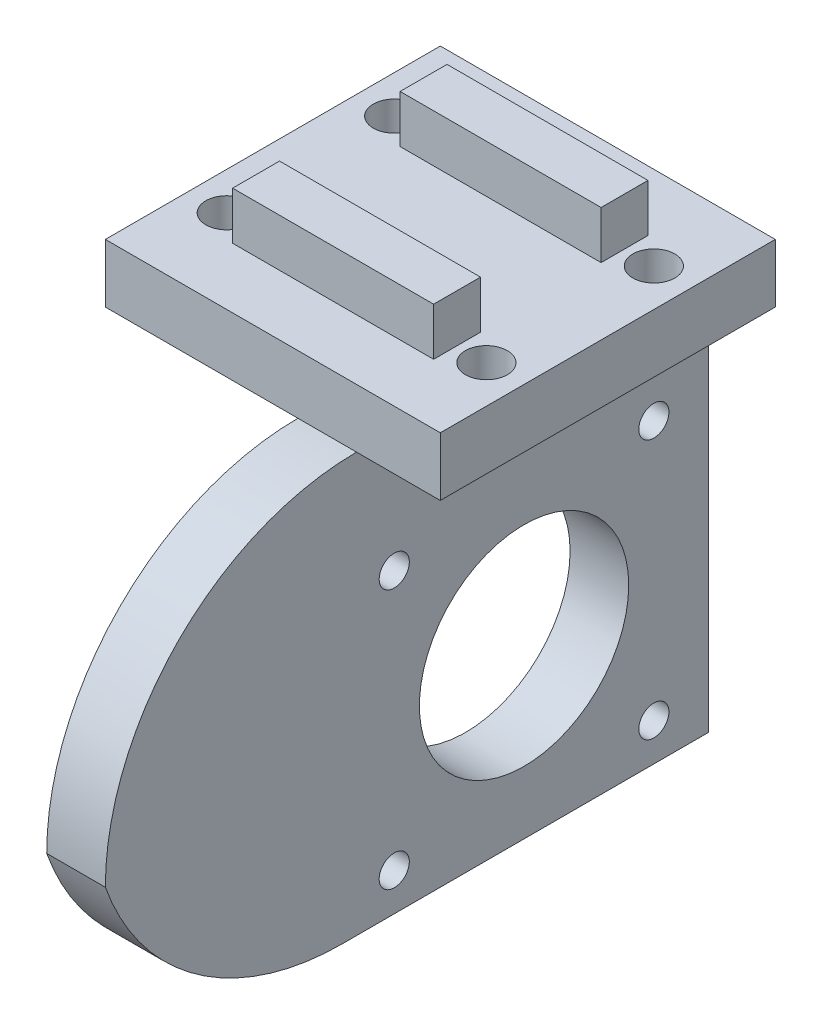
ISO-10303-21;
HEADER;
FILE_DESCRIPTION(('STEP AP214'),'2;1');
FILE_NAME('part.step','',(''),(''),'','','');
FILE_SCHEMA(('AUTOMOTIVE_DESIGN { 1 0 10303 214 1 1 1 1 }'));
ENDSEC;
DATA;
#1=APPLICATION_CONTEXT('core data for automotive mechanical design processes');
#2=APPLICATION_PROTOCOL_DEFINITION('international standard','automotive_design',2000,#1);
#3=PRODUCT_CONTEXT('',#1,'mechanical');
#4=PRODUCT('Part','Part','',(#3));
#5=PRODUCT_RELATED_PRODUCT_CATEGORY('part','',(#4));
#6=PRODUCT_DEFINITION_FORMATION('','',#4);
#7=PRODUCT_DEFINITION_CONTEXT('part definition',#1,'design');
#8=PRODUCT_DEFINITION('design','',#6,#7);
#9=PRODUCT_DEFINITION_SHAPE('','',#8);
#10=(LENGTH_UNIT() NAMED_UNIT(*) SI_UNIT(.MILLI.,.METRE.));
#11=(NAMED_UNIT(*) PLANE_ANGLE_UNIT() SI_UNIT($,.RADIAN.));
#12=(NAMED_UNIT(*) SI_UNIT($,.STERADIAN.) SOLID_ANGLE_UNIT());
#13=UNCERTAINTY_MEASURE_WITH_UNIT(LENGTH_MEASURE(1.E-05),#10,'distance_accuracy_value','');
#14=(GEOMETRIC_REPRESENTATION_CONTEXT(3) GLOBAL_UNCERTAINTY_ASSIGNED_CONTEXT((#13)) GLOBAL_UNIT_ASSIGNED_CONTEXT((#10,
#11,#12)) REPRESENTATION_CONTEXT('',''));
#15=CARTESIAN_POINT('',(0.,0.,0.));
#16=DIRECTION('',(0.,0.,1.));
#17=DIRECTION('',(1.,0.,0.));
#18=AXIS2_PLACEMENT_3D('',#15,#16,#17);
#19=CARTESIAN_POINT('',(0.,0.,0.));
#20=DIRECTION('',(0.,-1.,0.));
#21=DIRECTION('',(0.,0.,-1.));
#22=AXIS2_PLACEMENT_3D('',#19,#20,#21);
#23=PLANE('',#22);
#24=DIRECTION('',(0.,0.,-1.));
#25=VECTOR('',#24,1.);
#26=CARTESIAN_POINT('',(2.99999999999999,0.,50.));
#27=LINE('',#26,#25);
#28=CARTESIAN_POINT('',(3.,0.,20.));
#29=VERTEX_POINT('',#28);
#30=CARTESIAN_POINT('',(3.,0.,-20.));
#31=VERTEX_POINT('',#30);
#32=EDGE_CURVE('E303',#29,#31,#27,.T.);
#33=ORIENTED_EDGE('',*,*,#32,.F.);
#34=DIRECTION('',(1.,0.,0.));
#35=VECTOR('',#34,1.);
#36=CARTESIAN_POINT('',(20.,0.,20.));
#37=LINE('',#36,#35);
#38=CARTESIAN_POINT('',(-20.,0.,20.));
#39=VERTEX_POINT('',#38);
#40=EDGE_CURVE('E274',#39,#29,#37,.T.);
#41=ORIENTED_EDGE('',*,*,#40,.F.);
#42=DIRECTION('',(0.,0.,1.));
#43=VECTOR('',#42,1.);
#44=CARTESIAN_POINT('',(-20.,0.,-20.));
#45=LINE('',#44,#43);
#46=CARTESIAN_POINT('',(-20.,0.,-20.));
#47=VERTEX_POINT('',#46);
#48=EDGE_CURVE('E252',#47,#39,#45,.T.);
#49=ORIENTED_EDGE('',*,*,#48,.F.);
#50=DIRECTION('',(-1.,0.,0.));
#51=VECTOR('',#50,1.);
#52=CARTESIAN_POINT('',(20.,0.,-20.));
#53=LINE('',#52,#51);
#54=EDGE_CURVE('E280',#31,#47,#53,.T.);
#55=ORIENTED_EDGE('',*,*,#54,.F.);
#56=EDGE_LOOP('',(#33,#41,#49,#55));
#57=FACE_BOUND('',#56,.T.);
#58=CARTESIAN_POINT('',(-15.5,0.,-10.));
#59=DIRECTION('',(0.,-1.,0.));
#60=DIRECTION('',(0.,0.,-1.));
#61=AXIS2_PLACEMENT_3D('',#58,#59,#60);
#62=CIRCLE('',#61,2.5);
#63=CARTESIAN_POINT('',(-15.5,0.,-12.5));
#64=VERTEX_POINT('',#63);
#65=EDGE_CURVE('E207',#64,#64,#62,.F.);
#66=ORIENTED_EDGE('',*,*,#65,.T.);
#67=EDGE_LOOP('',(#66));
#68=FACE_BOUND('',#67,.T.);
#69=CARTESIAN_POINT('',(-15.5,0.,10.));
#70=DIRECTION('',(0.,-1.,0.));
#71=DIRECTION('',(0.,0.,-1.));
#72=AXIS2_PLACEMENT_3D('',#69,#70,#71);
#73=CIRCLE('',#72,2.5);
#74=CARTESIAN_POINT('',(-15.5,0.,7.50000000000001));
#75=VERTEX_POINT('',#74);
#76=EDGE_CURVE('E185',#75,#75,#73,.F.);
#77=ORIENTED_EDGE('',*,*,#76,.T.);
#78=EDGE_LOOP('',(#77));
#79=FACE_BOUND('',#78,.T.);
#80=ADVANCED_FACE('F34',(#57,#68,#79),#23,.T.);
#81=CARTESIAN_POINT('',(-20.,7.,-20.));
#82=DIRECTION('',(1.,0.,0.));
#83=DIRECTION('',(0.,0.,-1.));
#84=AXIS2_PLACEMENT_3D('',#81,#82,#83);
#85=PLANE('',#84);
#86=DIRECTION('',(0.,-1.,0.));
#87=VECTOR('',#86,1.);
#88=CARTESIAN_POINT('',(-20.,7.,20.));
#89=LINE('',#88,#87);
#90=CARTESIAN_POINT('',(-20.,7.,20.));
#91=VERTEX_POINT('',#90);
#92=EDGE_CURVE('E292',#91,#39,#89,.T.);
#93=ORIENTED_EDGE('',*,*,#92,.F.);
#94=DIRECTION('',(0.,0.,1.));
#95=VECTOR('',#94,1.);
#96=CARTESIAN_POINT('',(-20.,7.,-20.));
#97=LINE('',#96,#95);
#98=CARTESIAN_POINT('',(-20.,7.,-20.));
#99=VERTEX_POINT('',#98);
#100=EDGE_CURVE('E261',#99,#91,#97,.T.);
#101=ORIENTED_EDGE('',*,*,#100,.F.);
#102=DIRECTION('',(0.,-1.,0.));
#103=VECTOR('',#102,1.);
#104=CARTESIAN_POINT('',(-20.,7.,-20.));
#105=LINE('',#104,#103);
#106=EDGE_CURVE('E270',#99,#47,#105,.T.);
#107=ORIENTED_EDGE('',*,*,#106,.T.);
#108=ORIENTED_EDGE('',*,*,#48,.T.);
#109=EDGE_LOOP('',(#93,#101,#107,#108));
#110=FACE_BOUND('',#109,.T.);
#111=ADVANCED_FACE('F393',(#110),#85,.F.);
#112=CARTESIAN_POINT('',(20.,7.,20.));
#113=DIRECTION('',(0.,0.,-1.));
#114=DIRECTION('',(-1.,0.,0.));
#115=AXIS2_PLACEMENT_3D('',#112,#113,#114);
#116=PLANE('',#115);
#117=ORIENTED_EDGE('',*,*,#40,.T.);
#118=CARTESIAN_POINT('',(10.,0.,20.));
#119=VERTEX_POINT('',#118);
#120=EDGE_CURVE('E278',#29,#119,#37,.T.);
#121=ORIENTED_EDGE('',*,*,#120,.T.);
#122=CARTESIAN_POINT('',(20.,0.,20.));
#123=VERTEX_POINT('',#122);
#124=EDGE_CURVE('E273',#119,#123,#37,.T.);
#125=ORIENTED_EDGE('',*,*,#124,.T.);
#126=DIRECTION('',(0.,-1.,0.));
#127=VECTOR('',#126,1.);
#128=CARTESIAN_POINT('',(20.,7.,20.));
#129=LINE('',#128,#127);
#130=CARTESIAN_POINT('',(20.,7.,20.));
#131=VERTEX_POINT('',#130);
#132=EDGE_CURVE('E289',#131,#123,#129,.T.);
#133=ORIENTED_EDGE('',*,*,#132,.F.);
#134=DIRECTION('',(1.,0.,0.));
#135=VECTOR('',#134,1.);
#136=CARTESIAN_POINT('',(20.,7.,20.));
#137=LINE('',#136,#135);
#138=EDGE_CURVE('E263',#91,#131,#137,.T.);
#139=ORIENTED_EDGE('',*,*,#138,.F.);
#140=ORIENTED_EDGE('',*,*,#92,.T.);
#141=EDGE_LOOP('',(#117,#121,#125,#133,#139,#140));
#142=FACE_BOUND('',#141,.T.);
#143=ADVANCED_FACE('F367',(#142),#116,.F.);
#144=CARTESIAN_POINT('',(20.,7.,-20.));
#145=DIRECTION('',(-1.,0.,0.));
#146=DIRECTION('',(0.,0.,1.));
#147=AXIS2_PLACEMENT_3D('',#144,#145,#146);
#148=PLANE('',#147);
#149=DIRECTION('',(0.,-1.,0.));
#150=VECTOR('',#149,1.);
#151=CARTESIAN_POINT('',(20.,7.,-20.));
#152=LINE('',#151,#150);
#153=CARTESIAN_POINT('',(20.,7.,-20.));
#154=VERTEX_POINT('',#153);
#155=CARTESIAN_POINT('',(20.,0.,-20.));
#156=VERTEX_POINT('',#155);
#157=EDGE_CURVE('E286',#154,#156,#152,.T.);
#158=ORIENTED_EDGE('',*,*,#157,.F.);
#159=DIRECTION('',(0.,0.,-1.));
#160=VECTOR('',#159,1.);
#161=CARTESIAN_POINT('',(20.,7.,-20.));
#162=LINE('',#161,#160);
#163=EDGE_CURVE('E266',#131,#154,#162,.T.);
#164=ORIENTED_EDGE('',*,*,#163,.F.);
#165=ORIENTED_EDGE('',*,*,#132,.T.);
#166=DIRECTION('',(0.,0.,-1.));
#167=VECTOR('',#166,1.);
#168=CARTESIAN_POINT('',(20.,0.,-20.));
#169=LINE('',#168,#167);
#170=EDGE_CURVE('E277',#123,#156,#169,.T.);
#171=ORIENTED_EDGE('',*,*,#170,.T.);
#172=EDGE_LOOP('',(#158,#164,#165,#171));
#173=FACE_BOUND('',#172,.T.);
#174=ADVANCED_FACE('F380',(#173),#148,.F.);
#175=CARTESIAN_POINT('',(20.,7.,-20.));
#176=DIRECTION('',(0.,0.,1.));
#177=DIRECTION('',(1.,0.,0.));
#178=AXIS2_PLACEMENT_3D('',#175,#176,#177);
#179=PLANE('',#178);
#180=CARTESIAN_POINT('',(10.,0.,-20.));
#181=VERTEX_POINT('',#180);
#182=EDGE_CURVE('E264',#156,#181,#53,.T.);
#183=ORIENTED_EDGE('',*,*,#182,.T.);
#184=EDGE_CURVE('E283',#181,#31,#53,.T.);
#185=ORIENTED_EDGE('',*,*,#184,.T.);
#186=ORIENTED_EDGE('',*,*,#54,.T.);
#187=ORIENTED_EDGE('',*,*,#106,.F.);
#188=DIRECTION('',(-1.,0.,0.));
#189=VECTOR('',#188,1.);
#190=CARTESIAN_POINT('',(20.,7.,-20.));
#191=LINE('',#190,#189);
#192=EDGE_CURVE('E268',#154,#99,#191,.T.);
#193=ORIENTED_EDGE('',*,*,#192,.F.);
#194=ORIENTED_EDGE('',*,*,#157,.T.);
#195=EDGE_LOOP('',(#183,#185,#186,#187,#193,#194));
#196=FACE_BOUND('',#195,.T.);
#197=ADVANCED_FACE('F386',(#196),#179,.F.);
#198=CARTESIAN_POINT('',(0.,7.,0.));
#199=DIRECTION('',(0.,-1.,0.));
#200=DIRECTION('',(0.,0.,-1.));
#201=AXIS2_PLACEMENT_3D('',#198,#199,#200);
#202=PLANE('',#201);
#203=CARTESIAN_POINT('',(-15.5,7.,10.));
#204=DIRECTION('',(0.,1.,0.));
#205=DIRECTION('',(0.,0.,1.));
#206=AXIS2_PLACEMENT_3D('',#203,#204,#205);
#207=CIRCLE('',#206,2.5);
#208=CARTESIAN_POINT('',(-15.5,7.,12.5));
#209=VERTEX_POINT('',#208);
#210=EDGE_CURVE('E182',#209,#209,#207,.T.);
#211=ORIENTED_EDGE('',*,*,#210,.F.);
#212=EDGE_LOOP('',(#211));
#213=FACE_BOUND('',#212,.T.);
#214=CARTESIAN_POINT('',(15.5,7.,10.));
#215=DIRECTION('',(0.,1.,0.));
#216=DIRECTION('',(0.,0.,1.));
#217=AXIS2_PLACEMENT_3D('',#214,#215,#216);
#218=CIRCLE('',#217,2.5);
#219=CARTESIAN_POINT('',(15.5,7.,12.5));
#220=VERTEX_POINT('',#219);
#221=EDGE_CURVE('E198',#220,#220,#218,.T.);
#222=ORIENTED_EDGE('',*,*,#221,.F.);
#223=EDGE_LOOP('',(#222));
#224=FACE_BOUND('',#223,.T.);
#225=CARTESIAN_POINT('',(15.5,7.,-10.));
#226=DIRECTION('',(0.,1.,0.));
#227=DIRECTION('',(0.,0.,1.));
#228=AXIS2_PLACEMENT_3D('',#225,#226,#227);
#229=CIRCLE('',#228,2.49999999999999);
#230=CARTESIAN_POINT('',(15.5,7.,-7.5));
#231=VERTEX_POINT('',#230);
#232=EDGE_CURVE('E190',#231,#231,#229,.T.);
#233=ORIENTED_EDGE('',*,*,#232,.F.);
#234=EDGE_LOOP('',(#233));
#235=FACE_BOUND('',#234,.T.);
#236=CARTESIAN_POINT('',(-15.5,7.,-10.));
#237=DIRECTION('',(0.,1.,0.));
#238=DIRECTION('',(0.,0.,1.));
#239=AXIS2_PLACEMENT_3D('',#236,#237,#238);
#240=CIRCLE('',#239,2.5);
#241=CARTESIAN_POINT('',(-15.5,7.,-7.5));
#242=VERTEX_POINT('',#241);
#243=EDGE_CURVE('E197',#242,#242,#240,.T.);
#244=ORIENTED_EDGE('',*,*,#243,.F.);
#245=EDGE_LOOP('',(#244));
#246=FACE_BOUND('',#245,.T.);
#247=DIRECTION('',(0.,0.,-1.));
#248=VECTOR('',#247,1.);
#249=CARTESIAN_POINT('',(-12.,7.,-20.));
#250=LINE('',#249,#248);
#251=CARTESIAN_POINT('',(-12.,7.,12.8));
#252=VERTEX_POINT('',#251);
#253=CARTESIAN_POINT('',(-12.,7.,7.2));
#254=VERTEX_POINT('',#253);
#255=EDGE_CURVE('E218',#252,#254,#250,.T.);
#256=ORIENTED_EDGE('',*,*,#255,.T.);
#257=DIRECTION('',(-1.,0.,0.));
#258=VECTOR('',#257,1.);
#259=CARTESIAN_POINT('',(27.9906195003892,7.,7.19999999999999));
#260=LINE('',#259,#258);
#261=CARTESIAN_POINT('',(12.,7.,7.19999999999999));
#262=VERTEX_POINT('',#261);
#263=EDGE_CURVE('E236',#262,#254,#260,.T.);
#264=ORIENTED_EDGE('',*,*,#263,.F.);
#265=DIRECTION('',(0.,0.,1.));
#266=VECTOR('',#265,1.);
#267=CARTESIAN_POINT('',(12.,7.,-20.));
#268=LINE('',#267,#266);
#269=CARTESIAN_POINT('',(12.,7.,12.8));
#270=VERTEX_POINT('',#269);
#271=EDGE_CURVE('E221',#262,#270,#268,.T.);
#272=ORIENTED_EDGE('',*,*,#271,.T.);
#273=DIRECTION('',(-1.,0.,0.));
#274=VECTOR('',#273,1.);
#275=CARTESIAN_POINT('',(27.9906195003892,7.,12.8));
#276=LINE('',#275,#274);
#277=EDGE_CURVE('E244',#270,#252,#276,.T.);
#278=ORIENTED_EDGE('',*,*,#277,.T.);
#279=EDGE_LOOP('',(#256,#264,#272,#278));
#280=FACE_BOUND('',#279,.T.);
#281=CARTESIAN_POINT('',(-12.,7.,-7.2));
#282=VERTEX_POINT('',#281);
#283=CARTESIAN_POINT('',(-12.,7.,-12.8));
#284=VERTEX_POINT('',#283);
#285=EDGE_CURVE('E215',#282,#284,#250,.T.);
#286=ORIENTED_EDGE('',*,*,#285,.T.);
#287=DIRECTION('',(-1.,0.,0.));
#288=VECTOR('',#287,1.);
#289=CARTESIAN_POINT('',(27.9906195003892,7.,-12.8));
#290=LINE('',#289,#288);
#291=CARTESIAN_POINT('',(12.,7.,-12.8));
#292=VERTEX_POINT('',#291);
#293=EDGE_CURVE('E253',#292,#284,#290,.T.);
#294=ORIENTED_EDGE('',*,*,#293,.F.);
#295=CARTESIAN_POINT('',(12.,7.,-7.20000000000001));
#296=VERTEX_POINT('',#295);
#297=EDGE_CURVE('E214',#292,#296,#268,.T.);
#298=ORIENTED_EDGE('',*,*,#297,.T.);
#299=DIRECTION('',(-1.,0.,0.));
#300=VECTOR('',#299,1.);
#301=CARTESIAN_POINT('',(27.9906195003892,7.,-7.20000000000001));
#302=LINE('',#301,#300);
#303=EDGE_CURVE('E249',#296,#282,#302,.T.);
#304=ORIENTED_EDGE('',*,*,#303,.T.);
#305=EDGE_LOOP('',(#286,#294,#298,#304));
#306=FACE_BOUND('',#305,.T.);
#307=ORIENTED_EDGE('',*,*,#192,.T.);
#308=ORIENTED_EDGE('',*,*,#100,.T.);
#309=ORIENTED_EDGE('',*,*,#138,.T.);
#310=ORIENTED_EDGE('',*,*,#163,.T.);
#311=EDGE_LOOP('',(#307,#308,#309,#310));
#312=FACE_BOUND('',#311,.T.);
#313=ADVANCED_FACE('F395',(#213,#224,#235,#246,#280,#306,#312),#202,.F.);
#314=DIRECTION('',(0.,0.,1.));
#315=VECTOR('',#314,1.);
#316=CARTESIAN_POINT('',(9.99999999999999,0.,50.));
#317=LINE('',#316,#315);
#318=EDGE_CURVE('E299',#181,#119,#317,.T.);
#319=ORIENTED_EDGE('',*,*,#318,.F.);
#320=ORIENTED_EDGE('',*,*,#182,.F.);
#321=ORIENTED_EDGE('',*,*,#170,.F.);
#322=ORIENTED_EDGE('',*,*,#124,.F.);
#323=EDGE_LOOP('',(#319,#320,#321,#322));
#324=FACE_BOUND('',#323,.T.);
#325=CARTESIAN_POINT('',(15.5,0.,10.));
#326=DIRECTION('',(0.,-1.,0.));
#327=DIRECTION('',(0.,0.,-1.));
#328=AXIS2_PLACEMENT_3D('',#325,#326,#327);
#329=CIRCLE('',#328,2.5);
#330=CARTESIAN_POINT('',(15.5,0.,7.50000000000001));
#331=VERTEX_POINT('',#330);
#332=EDGE_CURVE('E194',#331,#331,#329,.F.);
#333=ORIENTED_EDGE('',*,*,#332,.T.);
#334=EDGE_LOOP('',(#333));
#335=FACE_BOUND('',#334,.T.);
#336=CARTESIAN_POINT('',(15.5,0.,-10.));
#337=DIRECTION('',(0.,-1.,0.));
#338=DIRECTION('',(0.,0.,-1.));
#339=AXIS2_PLACEMENT_3D('',#336,#337,#338);
#340=CIRCLE('',#339,2.49999999999999);
#341=CARTESIAN_POINT('',(15.5,0.,-12.5));
#342=VERTEX_POINT('',#341);
#343=EDGE_CURVE('E193',#342,#342,#340,.F.);
#344=ORIENTED_EDGE('',*,*,#343,.T.);
#345=EDGE_LOOP('',(#344));
#346=FACE_BOUND('',#345,.T.);
#347=ADVANCED_FACE('F382',(#324,#335,#346),#23,.T.);
#348=CARTESIAN_POINT('',(27.9906195003892,7.,-7.20000000000001));
#349=DIRECTION('',(0.,0.,1.));
#350=DIRECTION('',(1.,0.,0.));
#351=AXIS2_PLACEMENT_3D('',#348,#349,#350);
#352=PLANE('',#351);
#353=DIRECTION('',(0.,1.,0.));
#354=VECTOR('',#353,1.);
#355=CARTESIAN_POINT('',(-12.,7.,-7.2));
#356=LINE('',#355,#354);
#357=CARTESIAN_POINT('',(-12.,12.7,-7.2));
#358=VERTEX_POINT('',#357);
#359=EDGE_CURVE('E234',#282,#358,#356,.T.);
#360=ORIENTED_EDGE('',*,*,#359,.F.);
#361=ORIENTED_EDGE('',*,*,#303,.F.);
#362=DIRECTION('',(0.,-1.,0.));
#363=VECTOR('',#362,1.);
#364=CARTESIAN_POINT('',(12.,7.,-7.20000000000001));
#365=LINE('',#364,#363);
#366=CARTESIAN_POINT('',(12.,12.7,-7.2));
#367=VERTEX_POINT('',#366);
#368=EDGE_CURVE('E228',#367,#296,#365,.T.);
#369=ORIENTED_EDGE('',*,*,#368,.F.);
#370=DIRECTION('',(-1.,0.,0.));
#371=VECTOR('',#370,1.);
#372=CARTESIAN_POINT('',(27.9906195003892,12.7,-7.20000000000001));
#373=LINE('',#372,#371);
#374=EDGE_CURVE('E240',#367,#358,#373,.T.);
#375=ORIENTED_EDGE('',*,*,#374,.T.);
#376=EDGE_LOOP('',(#360,#361,#369,#375));
#377=FACE_BOUND('',#376,.T.);
#378=ADVANCED_FACE('F403',(#377),#352,.T.);
#379=CARTESIAN_POINT('',(27.9906195003892,7.,-12.8));
#380=DIRECTION('',(0.,0.,-1.));
#381=DIRECTION('',(0.,1.,0.));
#382=AXIS2_PLACEMENT_3D('',#379,#380,#381);
#383=PLANE('',#382);
#384=DIRECTION('',(0.,-1.,0.));
#385=VECTOR('',#384,1.);
#386=CARTESIAN_POINT('',(-12.,7.,-12.8));
#387=LINE('',#386,#385);
#388=CARTESIAN_POINT('',(-12.,12.7,-12.8));
#389=VERTEX_POINT('',#388);
#390=EDGE_CURVE('E232',#389,#284,#387,.T.);
#391=ORIENTED_EDGE('',*,*,#390,.F.);
#392=DIRECTION('',(-1.,0.,0.));
#393=VECTOR('',#392,1.);
#394=CARTESIAN_POINT('',(27.9906195003892,12.7,-12.8));
#395=LINE('',#394,#393);
#396=CARTESIAN_POINT('',(12.,12.7,-12.8));
#397=VERTEX_POINT('',#396);
#398=EDGE_CURVE('E256',#397,#389,#395,.T.);
#399=ORIENTED_EDGE('',*,*,#398,.F.);
#400=DIRECTION('',(0.,1.,0.));
#401=VECTOR('',#400,1.);
#402=CARTESIAN_POINT('',(12.,7.,-12.8));
#403=LINE('',#402,#401);
#404=EDGE_CURVE('E226',#292,#397,#403,.T.);
#405=ORIENTED_EDGE('',*,*,#404,.F.);
#406=ORIENTED_EDGE('',*,*,#293,.T.);
#407=EDGE_LOOP('',(#391,#399,#405,#406));
#408=FACE_BOUND('',#407,.T.);
#409=ADVANCED_FACE('F493',(#408),#383,.T.);
#410=CARTESIAN_POINT('',(27.9906195003892,12.7,-7.20000000000001));
#411=DIRECTION('',(0.,1.,0.));
#412=DIRECTION('',(0.,0.,1.));
#413=AXIS2_PLACEMENT_3D('',#410,#411,#412);
#414=PLANE('',#413);
#415=DIRECTION('',(0.,0.,-1.));
#416=VECTOR('',#415,1.);
#417=CARTESIAN_POINT('',(-12.,12.7,-20.));
#418=LINE('',#417,#416);
#419=EDGE_CURVE('E211',#358,#389,#418,.T.);
#420=ORIENTED_EDGE('',*,*,#419,.F.);
#421=ORIENTED_EDGE('',*,*,#374,.F.);
#422=DIRECTION('',(0.,0.,1.));
#423=VECTOR('',#422,1.);
#424=CARTESIAN_POINT('',(12.,12.7,-20.));
#425=LINE('',#424,#423);
#426=EDGE_CURVE('E220',#397,#367,#425,.T.);
#427=ORIENTED_EDGE('',*,*,#426,.F.);
#428=ORIENTED_EDGE('',*,*,#398,.T.);
#429=EDGE_LOOP('',(#420,#421,#427,#428));
#430=FACE_BOUND('',#429,.T.);
#431=ADVANCED_FACE('F491',(#430),#414,.T.);
#432=CARTESIAN_POINT('',(27.9906195003892,7.,7.19999999999999));
#433=DIRECTION('',(0.,0.,-1.));
#434=DIRECTION('',(-1.,0.,0.));
#435=AXIS2_PLACEMENT_3D('',#432,#433,#434);
#436=PLANE('',#435);
#437=DIRECTION('',(0.,-1.,0.));
#438=VECTOR('',#437,1.);
#439=CARTESIAN_POINT('',(-12.,7.,7.2));
#440=LINE('',#439,#438);
#441=CARTESIAN_POINT('',(-12.,12.7,7.19999999999999));
#442=VERTEX_POINT('',#441);
#443=EDGE_CURVE('E230',#442,#254,#440,.T.);
#444=ORIENTED_EDGE('',*,*,#443,.F.);
#445=DIRECTION('',(-1.,0.,0.));
#446=VECTOR('',#445,1.);
#447=CARTESIAN_POINT('',(27.9906195003892,12.7,7.19999999999999));
#448=LINE('',#447,#446);
#449=CARTESIAN_POINT('',(12.,12.7,7.19999999999999));
#450=VERTEX_POINT('',#449);
#451=EDGE_CURVE('E237',#450,#442,#448,.T.);
#452=ORIENTED_EDGE('',*,*,#451,.F.);
#453=DIRECTION('',(0.,1.,0.));
#454=VECTOR('',#453,1.);
#455=CARTESIAN_POINT('',(12.,7.,7.2));
#456=LINE('',#455,#454);
#457=EDGE_CURVE('E224',#262,#450,#456,.T.);
#458=ORIENTED_EDGE('',*,*,#457,.F.);
#459=ORIENTED_EDGE('',*,*,#263,.T.);
#460=EDGE_LOOP('',(#444,#452,#458,#459));
#461=FACE_BOUND('',#460,.T.);
#462=ADVANCED_FACE('F484',(#461),#436,.T.);
#463=CARTESIAN_POINT('',(27.9906195003892,12.7,7.19999999999999));
#464=DIRECTION('',(0.,1.,0.));
#465=DIRECTION('',(0.,0.,1.));
#466=AXIS2_PLACEMENT_3D('',#463,#464,#465);
#467=PLANE('',#466);
#468=CARTESIAN_POINT('',(-12.,12.7,12.8));
#469=VERTEX_POINT('',#468);
#470=EDGE_CURVE('E213',#469,#442,#418,.T.);
#471=ORIENTED_EDGE('',*,*,#470,.F.);
#472=DIRECTION('',(-1.,0.,0.));
#473=VECTOR('',#472,1.);
#474=CARTESIAN_POINT('',(27.9906195003892,12.7,12.8));
#475=LINE('',#474,#473);
#476=CARTESIAN_POINT('',(12.,12.7,12.8));
#477=VERTEX_POINT('',#476);
#478=EDGE_CURVE('E241',#477,#469,#475,.T.);
#479=ORIENTED_EDGE('',*,*,#478,.F.);
#480=EDGE_CURVE('E210',#450,#477,#425,.T.);
#481=ORIENTED_EDGE('',*,*,#480,.F.);
#482=ORIENTED_EDGE('',*,*,#451,.T.);
#483=EDGE_LOOP('',(#471,#479,#481,#482));
#484=FACE_BOUND('',#483,.T.);
#485=ADVANCED_FACE('F481',(#484),#467,.T.);
#486=CARTESIAN_POINT('',(27.9906195003892,7.,12.8));
#487=DIRECTION('',(0.,0.,1.));
#488=DIRECTION('',(1.,0.,0.));
#489=AXIS2_PLACEMENT_3D('',#486,#487,#488);
#490=PLANE('',#489);
#491=DIRECTION('',(0.,1.,0.));
#492=VECTOR('',#491,1.);
#493=CARTESIAN_POINT('',(-12.,7.,12.8));
#494=LINE('',#493,#492);
#495=EDGE_CURVE('E297',#252,#469,#494,.T.);
#496=ORIENTED_EDGE('',*,*,#495,.F.);
#497=ORIENTED_EDGE('',*,*,#277,.F.);
#498=DIRECTION('',(0.,-1.,0.));
#499=VECTOR('',#498,1.);
#500=CARTESIAN_POINT('',(12.,7.,12.8));
#501=LINE('',#500,#499);
#502=EDGE_CURVE('E295',#477,#270,#501,.T.);
#503=ORIENTED_EDGE('',*,*,#502,.F.);
#504=ORIENTED_EDGE('',*,*,#478,.T.);
#505=EDGE_LOOP('',(#496,#497,#503,#504));
#506=FACE_BOUND('',#505,.T.);
#507=ADVANCED_FACE('F479',(#506),#490,.T.);
#508=CARTESIAN_POINT('',(12.,-33.7921561087423,-20.));
#509=DIRECTION('',(-1.,0.,0.));
#510=DIRECTION('',(0.,0.,1.));
#511=AXIS2_PLACEMENT_3D('',#508,#509,#510);
#512=PLANE('',#511);
#513=ORIENTED_EDGE('',*,*,#457,.T.);
#514=ORIENTED_EDGE('',*,*,#480,.T.);
#515=ORIENTED_EDGE('',*,*,#502,.T.);
#516=ORIENTED_EDGE('',*,*,#271,.F.);
#517=EDGE_LOOP('',(#513,#514,#515,#516));
#518=FACE_BOUND('',#517,.T.);
#519=ADVANCED_FACE('F475',(#518),#512,.F.);
#520=CARTESIAN_POINT('',(-12.,-33.7921561087423,-20.));
#521=DIRECTION('',(1.,0.,0.));
#522=DIRECTION('',(0.,0.,-1.));
#523=AXIS2_PLACEMENT_3D('',#520,#521,#522);
#524=PLANE('',#523);
#525=ORIENTED_EDGE('',*,*,#443,.T.);
#526=ORIENTED_EDGE('',*,*,#255,.F.);
#527=ORIENTED_EDGE('',*,*,#495,.T.);
#528=ORIENTED_EDGE('',*,*,#470,.T.);
#529=EDGE_LOOP('',(#525,#526,#527,#528));
#530=FACE_BOUND('',#529,.T.);
#531=ADVANCED_FACE('F471',(#530),#524,.F.);
#532=ORIENTED_EDGE('',*,*,#368,.T.);
#533=ORIENTED_EDGE('',*,*,#297,.F.);
#534=ORIENTED_EDGE('',*,*,#404,.T.);
#535=ORIENTED_EDGE('',*,*,#426,.T.);
#536=EDGE_LOOP('',(#532,#533,#534,#535));
#537=FACE_BOUND('',#536,.T.);
#538=ADVANCED_FACE('F474',(#537),#512,.F.);
#539=ORIENTED_EDGE('',*,*,#359,.T.);
#540=ORIENTED_EDGE('',*,*,#419,.T.);
#541=ORIENTED_EDGE('',*,*,#390,.T.);
#542=ORIENTED_EDGE('',*,*,#285,.F.);
#543=EDGE_LOOP('',(#539,#540,#541,#542));
#544=FACE_BOUND('',#543,.T.);
#545=ADVANCED_FACE('F469',(#544),#524,.F.);
#546=CARTESIAN_POINT('',(-15.5,-7.07106781186548,-10.));
#547=DIRECTION('',(0.,1.,0.));
#548=DIRECTION('',(0.,0.,1.));
#549=AXIS2_PLACEMENT_3D('',#546,#547,#548);
#550=CYLINDRICAL_SURFACE('',#549,2.5);
#551=ORIENTED_EDGE('',*,*,#243,.T.);
#552=EDGE_LOOP('',(#551));
#553=FACE_BOUND('',#552,.T.);
#554=ORIENTED_EDGE('',*,*,#65,.F.);
#555=EDGE_LOOP('',(#554));
#556=FACE_BOUND('',#555,.T.);
#557=ADVANCED_FACE('F459',(#553,#556),#550,.F.);
#558=CARTESIAN_POINT('',(15.5,-7.07106781186548,-10.));
#559=DIRECTION('',(0.,1.,0.));
#560=DIRECTION('',(0.,0.,1.));
#561=AXIS2_PLACEMENT_3D('',#558,#559,#560);
#562=CYLINDRICAL_SURFACE('',#561,2.49999999999999);
#563=ORIENTED_EDGE('',*,*,#232,.T.);
#564=EDGE_LOOP('',(#563));
#565=FACE_BOUND('',#564,.T.);
#566=ORIENTED_EDGE('',*,*,#343,.F.);
#567=EDGE_LOOP('',(#566));
#568=FACE_BOUND('',#567,.T.);
#569=ADVANCED_FACE('F455',(#565,#568),#562,.F.);
#570=CARTESIAN_POINT('',(15.5,-7.07106781186548,10.));
#571=DIRECTION('',(0.,1.,0.));
#572=DIRECTION('',(0.,0.,1.));
#573=AXIS2_PLACEMENT_3D('',#570,#571,#572);
#574=CYLINDRICAL_SURFACE('',#573,2.5);
#575=ORIENTED_EDGE('',*,*,#221,.T.);
#576=EDGE_LOOP('',(#575));
#577=FACE_BOUND('',#576,.T.);
#578=ORIENTED_EDGE('',*,*,#332,.F.);
#579=EDGE_LOOP('',(#578));
#580=FACE_BOUND('',#579,.T.);
#581=ADVANCED_FACE('F458',(#577,#580),#574,.F.);
#582=CARTESIAN_POINT('',(-15.5,-7.07106781186548,10.));
#583=DIRECTION('',(0.,1.,0.));
#584=DIRECTION('',(0.,0.,1.));
#585=AXIS2_PLACEMENT_3D('',#582,#583,#584);
#586=CYLINDRICAL_SURFACE('',#585,2.5);
#587=ORIENTED_EDGE('',*,*,#210,.T.);
#588=EDGE_LOOP('',(#587));
#589=FACE_BOUND('',#588,.T.);
#590=ORIENTED_EDGE('',*,*,#76,.F.);
#591=EDGE_LOOP('',(#590));
#592=FACE_BOUND('',#591,.T.);
#593=ADVANCED_FACE('F446',(#589,#592),#586,.F.);
#594=CARTESIAN_POINT('',(0.,0.,0.));
#595=DIRECTION('',(0.,1.,0.));
#596=DIRECTION('',(0.,0.,1.));
#597=AXIS2_PLACEMENT_3D('',#594,#595,#596);
#598=PLANE('',#597);
#599=ORIENTED_EDGE('',*,*,#184,.F.);
#600=CARTESIAN_POINT('',(10.,0.,-22.));
#601=VERTEX_POINT('',#600);
#602=EDGE_CURVE('E167',#601,#181,#317,.T.);
#603=ORIENTED_EDGE('',*,*,#602,.F.);
#604=DIRECTION('',(1.,0.,0.));
#605=VECTOR('',#604,1.);
#606=CARTESIAN_POINT('',(10.,0.,-22.));
#607=LINE('',#606,#605);
#608=CARTESIAN_POINT('',(3.,0.,-22.));
#609=VERTEX_POINT('',#608);
#610=EDGE_CURVE('E354',#609,#601,#607,.T.);
#611=ORIENTED_EDGE('',*,*,#610,.F.);
#612=EDGE_CURVE('E180',#31,#609,#27,.T.);
#613=ORIENTED_EDGE('',*,*,#612,.F.);
#614=EDGE_LOOP('',(#599,#603,#611,#613));
#615=FACE_BOUND('',#614,.T.);
#616=ADVANCED_FACE('F389',(#615),#598,.T.);
#617=CARTESIAN_POINT('',(2.99999999999999,-50.,50.));
#618=DIRECTION('',(1.,0.,0.));
#619=DIRECTION('',(0.,0.,-1.));
#620=AXIS2_PLACEMENT_3D('',#617,#618,#619);
#621=PLANE('',#620);
#622=CARTESIAN_POINT('',(3.,-14.5,-15.5));
#623=DIRECTION('',(-1.,0.,0.));
#624=DIRECTION('',(0.,0.,1.));
#625=AXIS2_PLACEMENT_3D('',#622,#623,#624);
#626=CIRCLE('',#625,3.15);
#627=CARTESIAN_POINT('',(3.,-14.5,-12.35));
#628=VERTEX_POINT('',#627);
#629=EDGE_CURVE('E704',#628,#628,#626,.T.);
#630=ORIENTED_EDGE('',*,*,#629,.F.);
#631=EDGE_LOOP('',(#630));
#632=FACE_BOUND('',#631,.T.);
#633=CARTESIAN_POINT('',(3.,-14.5,15.5));
#634=DIRECTION('',(-1.,0.,0.));
#635=DIRECTION('',(0.,0.,1.));
#636=AXIS2_PLACEMENT_3D('',#633,#634,#635);
#637=CIRCLE('',#636,3.15);
#638=CARTESIAN_POINT('',(3.,-14.5,18.65));
#639=VERTEX_POINT('',#638);
#640=EDGE_CURVE('E327',#639,#639,#637,.T.);
#641=ORIENTED_EDGE('',*,*,#640,.F.);
#642=EDGE_LOOP('',(#641));
#643=FACE_BOUND('',#642,.T.);
#644=CARTESIAN_POINT('',(3.,-45.5,15.5));
#645=DIRECTION('',(-1.,0.,0.));
#646=DIRECTION('',(0.,0.,1.));
#647=AXIS2_PLACEMENT_3D('',#644,#645,#646);
#648=CIRCLE('',#647,3.15);
#649=CARTESIAN_POINT('',(3.,-45.5,18.65));
#650=VERTEX_POINT('',#649);
#651=EDGE_CURVE('E320',#650,#650,#648,.T.);
#652=ORIENTED_EDGE('',*,*,#651,.F.);
#653=EDGE_LOOP('',(#652));
#654=FACE_BOUND('',#653,.T.);
#655=CARTESIAN_POINT('',(3.,-45.5,-15.5));
#656=DIRECTION('',(-1.,0.,0.));
#657=DIRECTION('',(0.,0.,1.));
#658=AXIS2_PLACEMENT_3D('',#655,#656,#657);
#659=CIRCLE('',#658,3.15);
#660=CARTESIAN_POINT('',(3.,-45.5,-12.35));
#661=VERTEX_POINT('',#660);
#662=EDGE_CURVE('E316',#661,#661,#659,.T.);
#663=ORIENTED_EDGE('',*,*,#662,.F.);
#664=EDGE_LOOP('',(#663));
#665=FACE_BOUND('',#664,.T.);
#666=CARTESIAN_POINT('',(3.,-30.,30.));
#667=DIRECTION('',(1.,0.,0.));
#668=DIRECTION('',(0.,0.,-1.));
#669=AXIS2_PLACEMENT_3D('',#666,#667,#668);
#670=CIRCLE('',#669,4.25);
#671=CARTESIAN_POINT('',(3.,-30.,25.75));
#672=VERTEX_POINT('',#671);
#673=EDGE_CURVE('E312',#672,#672,#670,.T.);
#674=ORIENTED_EDGE('',*,*,#673,.T.);
#675=EDGE_LOOP('',(#674));
#676=FACE_BOUND('',#675,.T.);
#677=CARTESIAN_POINT('',(3.,-30.,0.));
#678=DIRECTION('',(1.,0.,0.));
#679=DIRECTION('',(0.,0.,-1.));
#680=AXIS2_PLACEMENT_3D('',#677,#678,#679);
#681=CIRCLE('',#680,12.5);
#682=CARTESIAN_POINT('',(3.,-30.,-12.5));
#683=VERTEX_POINT('',#682);
#684=EDGE_CURVE('E349',#683,#683,#681,.F.);
#685=ORIENTED_EDGE('',*,*,#684,.F.);
#686=EDGE_LOOP('',(#685));
#687=FACE_BOUND('',#686,.T.);
#688=DIRECTION('',(0.,0.,-1.));
#689=VECTOR('',#688,1.);
#690=CARTESIAN_POINT('',(2.99999999999999,-50.,50.));
#691=LINE('',#690,#689);
#692=CARTESIAN_POINT('',(3.,-50.,21.7157287525381));
#693=VERTEX_POINT('',#692);
#694=CARTESIAN_POINT('',(3.,-50.,-22.));
#695=VERTEX_POINT('',#694);
#696=EDGE_CURVE('E159',#693,#695,#691,.T.);
#697=ORIENTED_EDGE('',*,*,#696,.F.);
#698=CARTESIAN_POINT('',(3.,-20.,21.7157287525381));
#699=DIRECTION('',(1.,0.,0.));
#700=DIRECTION('',(0.,0.,-1.));
#701=AXIS2_PLACEMENT_3D('',#698,#699,#700);
#702=CIRCLE('',#701,30.);
#703=CARTESIAN_POINT('',(2.99999999999999,-30.,50.));
#704=VERTEX_POINT('',#703);
#705=EDGE_CURVE('E43',#693,#704,#702,.F.);
#706=ORIENTED_EDGE('',*,*,#705,.T.);
#707=CARTESIAN_POINT('',(3.,-30.,20.));
#708=DIRECTION('',(1.,0.,0.));
#709=DIRECTION('',(0.,0.,-1.));
#710=AXIS2_PLACEMENT_3D('',#707,#708,#709);
#711=CIRCLE('',#710,30.);
#712=EDGE_CURVE('E302',#704,#29,#711,.F.);
#713=ORIENTED_EDGE('',*,*,#712,.T.);
#714=ORIENTED_EDGE('',*,*,#32,.T.);
#715=ORIENTED_EDGE('',*,*,#612,.T.);
#716=DIRECTION('',(0.,1.,0.));
#717=VECTOR('',#716,1.);
#718=CARTESIAN_POINT('',(3.,-50.,-22.));
#719=LINE('',#718,#717);
#720=EDGE_CURVE('E172',#695,#609,#719,.T.);
#721=ORIENTED_EDGE('',*,*,#720,.F.);
#722=EDGE_LOOP('',(#697,#706,#713,#714,#715,#721));
#723=FACE_BOUND('',#722,.T.);
#724=ADVANCED_FACE('F177',(#632,#643,#654,#665,#676,#687,#723),#621,.F.);
#725=CARTESIAN_POINT('',(10.,-50.,-22.));
#726=DIRECTION('',(0.,0.,1.));
#727=DIRECTION('',(1.,0.,0.));
#728=AXIS2_PLACEMENT_3D('',#725,#726,#727);
#729=PLANE('',#728);
#730=ORIENTED_EDGE('',*,*,#610,.T.);
#731=DIRECTION('',(0.,1.,0.));
#732=VECTOR('',#731,1.);
#733=CARTESIAN_POINT('',(10.,-50.,-22.));
#734=LINE('',#733,#732);
#735=CARTESIAN_POINT('',(10.,-50.,-22.));
#736=VERTEX_POINT('',#735);
#737=EDGE_CURVE('E174',#736,#601,#734,.T.);
#738=ORIENTED_EDGE('',*,*,#737,.F.);
#739=DIRECTION('',(1.,0.,0.));
#740=VECTOR('',#739,1.);
#741=CARTESIAN_POINT('',(10.,-50.,-22.));
#742=LINE('',#741,#740);
#743=EDGE_CURVE('E162',#695,#736,#742,.T.);
#744=ORIENTED_EDGE('',*,*,#743,.F.);
#745=ORIENTED_EDGE('',*,*,#720,.T.);
#746=EDGE_LOOP('',(#730,#738,#744,#745));
#747=FACE_BOUND('',#746,.T.);
#748=ADVANCED_FACE('F171',(#747),#729,.F.);
#749=CARTESIAN_POINT('',(9.99999999999999,-50.,50.));
#750=DIRECTION('',(-1.,0.,0.));
#751=DIRECTION('',(0.,0.,1.));
#752=AXIS2_PLACEMENT_3D('',#749,#750,#751);
#753=PLANE('',#752);
#754=CARTESIAN_POINT('',(10.,-14.5,-15.5));
#755=DIRECTION('',(-1.,0.,0.));
#756=DIRECTION('',(0.,0.,1.));
#757=AXIS2_PLACEMENT_3D('',#754,#755,#756);
#758=CIRCLE('',#757,1.8);
#759=CARTESIAN_POINT('',(10.,-14.5,-13.7));
#760=VERTEX_POINT('',#759);
#761=EDGE_CURVE('E38',#760,#760,#758,.T.);
#762=ORIENTED_EDGE('',*,*,#761,.T.);
#763=EDGE_LOOP('',(#762));
#764=FACE_BOUND('',#763,.T.);
#765=CARTESIAN_POINT('',(10.,-14.5,15.5));
#766=DIRECTION('',(-1.,0.,0.));
#767=DIRECTION('',(0.,0.,1.));
#768=AXIS2_PLACEMENT_3D('',#765,#766,#767);
#769=CIRCLE('',#768,1.8);
#770=CARTESIAN_POINT('',(10.,-14.5,17.3));
#771=VERTEX_POINT('',#770);
#772=EDGE_CURVE('E318',#771,#771,#769,.T.);
#773=ORIENTED_EDGE('',*,*,#772,.T.);
#774=EDGE_LOOP('',(#773));
#775=FACE_BOUND('',#774,.T.);
#776=CARTESIAN_POINT('',(10.,-45.5,15.5));
#777=DIRECTION('',(-1.,0.,0.));
#778=DIRECTION('',(0.,0.,1.));
#779=AXIS2_PLACEMENT_3D('',#776,#777,#778);
#780=CIRCLE('',#779,1.8);
#781=CARTESIAN_POINT('',(10.,-45.5,17.3));
#782=VERTEX_POINT('',#781);
#783=EDGE_CURVE('E314',#782,#782,#780,.T.);
#784=ORIENTED_EDGE('',*,*,#783,.T.);
#785=EDGE_LOOP('',(#784));
#786=FACE_BOUND('',#785,.T.);
#787=CARTESIAN_POINT('',(10.,-45.5,-15.5));
#788=DIRECTION('',(-1.,0.,0.));
#789=DIRECTION('',(0.,0.,1.));
#790=AXIS2_PLACEMENT_3D('',#787,#788,#789);
#791=CIRCLE('',#790,1.8);
#792=CARTESIAN_POINT('',(10.,-45.5,-13.7));
#793=VERTEX_POINT('',#792);
#794=EDGE_CURVE('E309',#793,#793,#791,.T.);
#795=ORIENTED_EDGE('',*,*,#794,.T.);
#796=EDGE_LOOP('',(#795));
#797=FACE_BOUND('',#796,.T.);
#798=CARTESIAN_POINT('',(10.,-30.,0.));
#799=DIRECTION('',(1.,0.,0.));
#800=DIRECTION('',(0.,0.,-1.));
#801=AXIS2_PLACEMENT_3D('',#798,#799,#800);
#802=CIRCLE('',#801,12.5);
#803=CARTESIAN_POINT('',(10.,-30.,-12.5));
#804=VERTEX_POINT('',#803);
#805=EDGE_CURVE('E344',#804,#804,#802,.T.);
#806=ORIENTED_EDGE('',*,*,#805,.F.);
#807=EDGE_LOOP('',(#806));
#808=FACE_BOUND('',#807,.T.);
#809=CARTESIAN_POINT('',(10.,-30.,20.));
#810=DIRECTION('',(-1.,0.,0.));
#811=DIRECTION('',(0.,0.,1.));
#812=AXIS2_PLACEMENT_3D('',#809,#810,#811);
#813=CIRCLE('',#812,30.);
#814=CARTESIAN_POINT('',(9.99999999999999,-30.,50.));
#815=VERTEX_POINT('',#814);
#816=EDGE_CURVE('E305',#119,#815,#813,.F.);
#817=ORIENTED_EDGE('',*,*,#816,.T.);
#818=CARTESIAN_POINT('',(10.,-20.,21.7157287525381));
#819=DIRECTION('',(-1.,0.,0.));
#820=DIRECTION('',(0.,0.,1.));
#821=AXIS2_PLACEMENT_3D('',#818,#819,#820);
#822=CIRCLE('',#821,30.);
#823=CARTESIAN_POINT('',(10.,-50.,21.7157287525381));
#824=VERTEX_POINT('',#823);
#825=EDGE_CURVE('E11',#815,#824,#822,.F.);
#826=ORIENTED_EDGE('',*,*,#825,.T.);
#827=DIRECTION('',(0.,0.,1.));
#828=VECTOR('',#827,1.);
#829=CARTESIAN_POINT('',(9.99999999999999,-50.,50.));
#830=LINE('',#829,#828);
#831=EDGE_CURVE('E175',#736,#824,#830,.T.);
#832=ORIENTED_EDGE('',*,*,#831,.F.);
#833=ORIENTED_EDGE('',*,*,#737,.T.);
#834=ORIENTED_EDGE('',*,*,#602,.T.);
#835=ORIENTED_EDGE('',*,*,#318,.T.);
#836=EDGE_LOOP('',(#817,#826,#832,#833,#834,#835));
#837=FACE_BOUND('',#836,.T.);
#838=ADVANCED_FACE('F443',(#764,#775,#786,#797,#808,#837),#753,.F.);
#839=CARTESIAN_POINT('',(0.,-50.,0.));
#840=DIRECTION('',(0.,1.,0.));
#841=DIRECTION('',(0.,0.,1.));
#842=AXIS2_PLACEMENT_3D('',#839,#840,#841);
#843=PLANE('',#842);
#844=ORIENTED_EDGE('',*,*,#831,.T.);
#845=DIRECTION('',(-1.,0.,0.));
#846=VECTOR('',#845,1.);
#847=CARTESIAN_POINT('',(0.,-50.,21.7157287525381));
#848=LINE('',#847,#846);
#849=EDGE_CURVE('E164',#824,#693,#848,.T.);
#850=ORIENTED_EDGE('',*,*,#849,.T.);
#851=ORIENTED_EDGE('',*,*,#696,.T.);
#852=ORIENTED_EDGE('',*,*,#743,.T.);
#853=EDGE_LOOP('',(#844,#850,#851,#852));
#854=FACE_BOUND('',#853,.T.);
#855=ADVANCED_FACE('F161',(#854),#843,.F.);
#856=CARTESIAN_POINT('',(-32.3553390593274,-30.,0.));
#857=DIRECTION('',(1.,0.,0.));
#858=DIRECTION('',(0.,0.,-1.));
#859=AXIS2_PLACEMENT_3D('',#856,#857,#858);
#860=CYLINDRICAL_SURFACE('',#859,12.5);
#861=ORIENTED_EDGE('',*,*,#684,.T.);
#862=EDGE_LOOP('',(#861));
#863=FACE_BOUND('',#862,.T.);
#864=ORIENTED_EDGE('',*,*,#805,.T.);
#865=EDGE_LOOP('',(#864));
#866=FACE_BOUND('',#865,.T.);
#867=ADVANCED_FACE('F431',(#863,#866),#860,.F.);
#868=CARTESIAN_POINT('',(6.5,-30.,30.));
#869=DIRECTION('',(-1.,0.,0.));
#870=DIRECTION('',(0.,0.,1.));
#871=AXIS2_PLACEMENT_3D('',#868,#869,#870);
#872=CYLINDRICAL_SURFACE('',#871,4.25);
#873=CARTESIAN_POINT('',(6.5,-30.,30.));
#874=DIRECTION('',(1.,0.,0.));
#875=DIRECTION('',(0.,0.,-1.));
#876=AXIS2_PLACEMENT_3D('',#873,#874,#875);
#877=CIRCLE('',#876,4.25);
#878=CARTESIAN_POINT('',(6.5,-30.,25.75));
#879=VERTEX_POINT('',#878);
#880=EDGE_CURVE('E341',#879,#879,#877,.T.);
#881=ORIENTED_EDGE('',*,*,#880,.T.);
#882=EDGE_LOOP('',(#881));
#883=FACE_BOUND('',#882,.T.);
#884=ORIENTED_EDGE('',*,*,#673,.F.);
#885=EDGE_LOOP('',(#884));
#886=FACE_BOUND('',#885,.T.);
#887=ADVANCED_FACE('F425',(#883,#886),#872,.F.);
#888=CARTESIAN_POINT('',(6.5,-30.,30.));
#889=DIRECTION('',(1.,0.,0.));
#890=DIRECTION('',(0.,0.,-1.));
#891=AXIS2_PLACEMENT_3D('',#888,#889,#890);
#892=PLANE('',#891);
#893=ORIENTED_EDGE('',*,*,#880,.F.);
#894=EDGE_LOOP('',(#893));
#895=FACE_BOUND('',#894,.T.);
#896=ADVANCED_FACE('F419',(#895),#892,.F.);
#897=CARTESIAN_POINT('',(9.99999999999997,-30.,20.));
#898=DIRECTION('',(1.,0.,0.));
#899=DIRECTION('',(0.,0.,-1.));
#900=AXIS2_PLACEMENT_3D('',#897,#898,#899);
#901=CYLINDRICAL_SURFACE('',#900,30.);
#902=ORIENTED_EDGE('',*,*,#816,.F.);
#903=ORIENTED_EDGE('',*,*,#120,.F.);
#904=ORIENTED_EDGE('',*,*,#712,.F.);
#905=DIRECTION('',(-1.,0.,0.));
#906=VECTOR('',#905,1.);
#907=CARTESIAN_POINT('',(3.,-30.,50.));
#908=LINE('',#907,#906);
#909=EDGE_CURVE('E300',#815,#704,#908,.T.);
#910=ORIENTED_EDGE('',*,*,#909,.F.);
#911=EDGE_LOOP('',(#902,#903,#904,#910));
#912=FACE_BOUND('',#911,.T.);
#913=ADVANCED_FACE('F372',(#912),#901,.T.);
#914=CARTESIAN_POINT('',(9.99999999999997,-20.,21.7157287525381));
#915=DIRECTION('',(-1.,0.,0.));
#916=DIRECTION('',(0.,0.,1.));
#917=AXIS2_PLACEMENT_3D('',#914,#915,#916);
#918=CYLINDRICAL_SURFACE('',#917,30.);
#919=ORIENTED_EDGE('',*,*,#825,.F.);
#920=ORIENTED_EDGE('',*,*,#909,.T.);
#921=ORIENTED_EDGE('',*,*,#705,.F.);
#922=ORIENTED_EDGE('',*,*,#849,.F.);
#923=EDGE_LOOP('',(#919,#920,#921,#922));
#924=FACE_BOUND('',#923,.T.);
#925=ADVANCED_FACE('F36',(#924),#918,.T.);
#926=CARTESIAN_POINT('',(3.,-45.5,-15.5));
#927=DIRECTION('',(-1.,0.,0.));
#928=DIRECTION('',(0.,0.,1.));
#929=AXIS2_PLACEMENT_3D('',#926,#927,#928);
#930=CYLINDRICAL_SURFACE('',#929,1.8);
#931=CARTESIAN_POINT('',(4.35,-45.5,-15.5));
#932=DIRECTION('',(-1.,0.,0.));
#933=DIRECTION('',(0.,0.,1.));
#934=AXIS2_PLACEMENT_3D('',#931,#932,#933);
#935=CIRCLE('',#934,1.8);
#936=CARTESIAN_POINT('',(4.35,-45.5,-13.7));
#937=VERTEX_POINT('',#936);
#938=EDGE_CURVE('E313',#937,#937,#935,.T.);
#939=ORIENTED_EDGE('',*,*,#938,.T.);
#940=EDGE_LOOP('',(#939));
#941=FACE_BOUND('',#940,.T.);
#942=ORIENTED_EDGE('',*,*,#794,.F.);
#943=EDGE_LOOP('',(#942));
#944=FACE_BOUND('',#943,.T.);
#945=ADVANCED_FACE('F424',(#941,#944),#930,.F.);
#946=CARTESIAN_POINT('',(3.,-45.5,-15.5));
#947=DIRECTION('',(-1.,0.,0.));
#948=DIRECTION('',(0.,0.,1.));
#949=AXIS2_PLACEMENT_3D('',#946,#947,#948);
#950=CONICAL_SURFACE('',#949,3.15,0.785398163397449);
#951=ORIENTED_EDGE('',*,*,#938,.F.);
#952=EDGE_LOOP('',(#951));
#953=FACE_BOUND('',#952,.T.);
#954=ORIENTED_EDGE('',*,*,#662,.T.);
#955=EDGE_LOOP('',(#954));
#956=FACE_BOUND('',#955,.T.);
#957=ADVANCED_FACE('F627',(#953,#956),#950,.F.);
#958=CARTESIAN_POINT('',(3.,-45.5,15.5));
#959=DIRECTION('',(-1.,0.,0.));
#960=DIRECTION('',(0.,0.,1.));
#961=AXIS2_PLACEMENT_3D('',#958,#959,#960);
#962=CYLINDRICAL_SURFACE('',#961,1.8);
#963=CARTESIAN_POINT('',(4.35,-45.5,15.5));
#964=DIRECTION('',(-1.,0.,0.));
#965=DIRECTION('',(0.,0.,1.));
#966=AXIS2_PLACEMENT_3D('',#963,#964,#965);
#967=CIRCLE('',#966,1.8);
#968=CARTESIAN_POINT('',(4.35,-45.5,17.3));
#969=VERTEX_POINT('',#968);
#970=EDGE_CURVE('E317',#969,#969,#967,.T.);
#971=ORIENTED_EDGE('',*,*,#970,.T.);
#972=EDGE_LOOP('',(#971));
#973=FACE_BOUND('',#972,.T.);
#974=ORIENTED_EDGE('',*,*,#783,.F.);
#975=EDGE_LOOP('',(#974));
#976=FACE_BOUND('',#975,.T.);
#977=ADVANCED_FACE('F636',(#973,#976),#962,.F.);
#978=CARTESIAN_POINT('',(3.,-45.5,15.5));
#979=DIRECTION('',(-1.,0.,0.));
#980=DIRECTION('',(0.,0.,1.));
#981=AXIS2_PLACEMENT_3D('',#978,#979,#980);
#982=CONICAL_SURFACE('',#981,3.15,0.785398163397449);
#983=ORIENTED_EDGE('',*,*,#970,.F.);
#984=EDGE_LOOP('',(#983));
#985=FACE_BOUND('',#984,.T.);
#986=ORIENTED_EDGE('',*,*,#651,.T.);
#987=EDGE_LOOP('',(#986));
#988=FACE_BOUND('',#987,.T.);
#989=ADVANCED_FACE('F645',(#985,#988),#982,.F.);
#990=CARTESIAN_POINT('',(3.,-14.5,15.5));
#991=DIRECTION('',(-1.,0.,0.));
#992=DIRECTION('',(0.,0.,1.));
#993=AXIS2_PLACEMENT_3D('',#990,#991,#992);
#994=CYLINDRICAL_SURFACE('',#993,1.8);
#995=CARTESIAN_POINT('',(4.35,-14.5,15.5));
#996=DIRECTION('',(-1.,0.,0.));
#997=DIRECTION('',(0.,0.,1.));
#998=AXIS2_PLACEMENT_3D('',#995,#996,#997);
#999=CIRCLE('',#998,1.8);
#1000=CARTESIAN_POINT('',(4.35,-14.5,17.3));
#1001=VERTEX_POINT('',#1000);
#1002=EDGE_CURVE('E321',#1001,#1001,#999,.T.);
#1003=ORIENTED_EDGE('',*,*,#1002,.T.);
#1004=EDGE_LOOP('',(#1003));
#1005=FACE_BOUND('',#1004,.T.);
#1006=ORIENTED_EDGE('',*,*,#772,.F.);
#1007=EDGE_LOOP('',(#1006));
#1008=FACE_BOUND('',#1007,.T.);
#1009=ADVANCED_FACE('F655',(#1005,#1008),#994,.F.);
#1010=CARTESIAN_POINT('',(3.,-14.5,15.5));
#1011=DIRECTION('',(-1.,0.,0.));
#1012=DIRECTION('',(0.,0.,1.));
#1013=AXIS2_PLACEMENT_3D('',#1010,#1011,#1012);
#1014=CONICAL_SURFACE('',#1013,3.15,0.785398163397448);
#1015=ORIENTED_EDGE('',*,*,#1002,.F.);
#1016=EDGE_LOOP('',(#1015));
#1017=FACE_BOUND('',#1016,.T.);
#1018=ORIENTED_EDGE('',*,*,#640,.T.);
#1019=EDGE_LOOP('',(#1018));
#1020=FACE_BOUND('',#1019,.T.);
#1021=ADVANCED_FACE('F665',(#1017,#1020),#1014,.F.);
#1022=CARTESIAN_POINT('',(3.,-14.5,-15.5));
#1023=DIRECTION('',(-1.,0.,0.));
#1024=DIRECTION('',(0.,0.,1.));
#1025=AXIS2_PLACEMENT_3D('',#1022,#1023,#1024);
#1026=CYLINDRICAL_SURFACE('',#1025,1.8);
#1027=CARTESIAN_POINT('',(4.35,-14.5,-15.5));
#1028=DIRECTION('',(-1.,0.,0.));
#1029=DIRECTION('',(0.,0.,1.));
#1030=AXIS2_PLACEMENT_3D('',#1027,#1028,#1029);
#1031=CIRCLE('',#1030,1.8);
#1032=CARTESIAN_POINT('',(4.35,-14.5,-13.7));
#1033=VERTEX_POINT('',#1032);
#1034=EDGE_CURVE('E701',#1033,#1033,#1031,.T.);
#1035=ORIENTED_EDGE('',*,*,#1034,.T.);
#1036=EDGE_LOOP('',(#1035));
#1037=FACE_BOUND('',#1036,.T.);
#1038=ORIENTED_EDGE('',*,*,#761,.F.);
#1039=EDGE_LOOP('',(#1038));
#1040=FACE_BOUND('',#1039,.T.);
#1041=ADVANCED_FACE('F674',(#1037,#1040),#1026,.F.);
#1042=CARTESIAN_POINT('',(3.,-14.5,-15.5));
#1043=DIRECTION('',(-1.,0.,0.));
#1044=DIRECTION('',(0.,0.,1.));
#1045=AXIS2_PLACEMENT_3D('',#1042,#1043,#1044);
#1046=CONICAL_SURFACE('',#1045,3.15,0.785398163397447);
#1047=ORIENTED_EDGE('',*,*,#1034,.F.);
#1048=EDGE_LOOP('',(#1047));
#1049=FACE_BOUND('',#1048,.T.);
#1050=ORIENTED_EDGE('',*,*,#629,.T.);
#1051=EDGE_LOOP('',(#1050));
#1052=FACE_BOUND('',#1051,.T.);
#1053=ADVANCED_FACE('F684',(#1049,#1052),#1046,.F.);
#1054=CLOSED_SHELL('',(#80,#111,#143,#174,#197,#313,#347,#378,#409,#431,#462,#485,#507,#519,
#531,#538,#545,#557,#569,#581,#593,#616,#724,#748,#838,#855,#867,#887,#896,#913,#925,#945,#957,
#977,#989,#1009,#1021,#1041,#1053));
#1055=MANIFOLD_SOLID_BREP('B2',#1054);
#1056=ADVANCED_BREP_SHAPE_REPRESENTATION('',(#18,#1055),#14);
#1057=SHAPE_DEFINITION_REPRESENTATION(#9,#1056);
ENDSEC;
END-ISO-10303-21;
